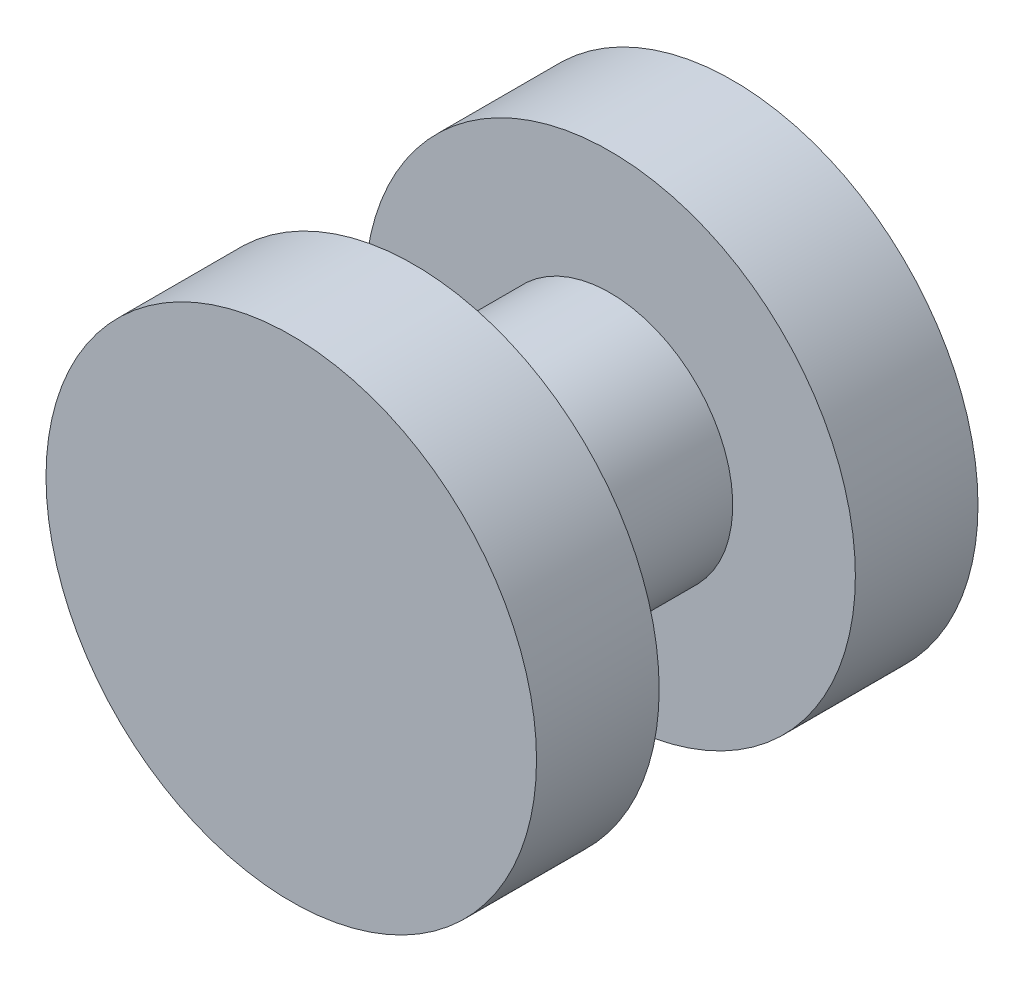
ISO-10303-21;
HEADER;
FILE_DESCRIPTION(('STEP AP214'),'2;1');
FILE_NAME('part.step','',(''),(''),'','','');
FILE_SCHEMA(('AUTOMOTIVE_DESIGN { 1 0 10303 214 1 1 1 1 }'));
ENDSEC;
DATA;
#1=APPLICATION_CONTEXT('core data for automotive mechanical design processes');
#2=APPLICATION_PROTOCOL_DEFINITION('international standard','automotive_design',2000,#1);
#3=PRODUCT_CONTEXT('',#1,'mechanical');
#4=PRODUCT('Part','Part','',(#3));
#5=PRODUCT_RELATED_PRODUCT_CATEGORY('part','',(#4));
#6=PRODUCT_DEFINITION_FORMATION('','',#4);
#7=PRODUCT_DEFINITION_CONTEXT('part definition',#1,'design');
#8=PRODUCT_DEFINITION('design','',#6,#7);
#9=PRODUCT_DEFINITION_SHAPE('','',#8);
#10=(LENGTH_UNIT() NAMED_UNIT(*) SI_UNIT(.MILLI.,.METRE.));
#11=(NAMED_UNIT(*) PLANE_ANGLE_UNIT() SI_UNIT($,.RADIAN.));
#12=(NAMED_UNIT(*) SI_UNIT($,.STERADIAN.) SOLID_ANGLE_UNIT());
#13=UNCERTAINTY_MEASURE_WITH_UNIT(LENGTH_MEASURE(1.E-05),#10,'distance_accuracy_value','');
#14=(GEOMETRIC_REPRESENTATION_CONTEXT(3) GLOBAL_UNCERTAINTY_ASSIGNED_CONTEXT((#13)) GLOBAL_UNIT_ASSIGNED_CONTEXT((#10,
#11,#12)) REPRESENTATION_CONTEXT('',''));
#15=CARTESIAN_POINT('',(0.,0.,0.));
#16=DIRECTION('',(0.,0.,1.));
#17=DIRECTION('',(1.,0.,0.));
#18=AXIS2_PLACEMENT_3D('',#15,#16,#17);
#19=CARTESIAN_POINT('',(0.,0.,5.08));
#20=DIRECTION('',(0.,0.,-1.));
#21=DIRECTION('',(-1.,0.,0.));
#22=AXIS2_PLACEMENT_3D('',#19,#20,#21);
#23=CYLINDRICAL_SURFACE('',#22,3.175);
#24=CARTESIAN_POINT('',(0.,0.,5.08));
#25=DIRECTION('',(0.,0.,1.));
#26=DIRECTION('',(1.,0.,0.));
#27=AXIS2_PLACEMENT_3D('',#24,#25,#26);
#28=CIRCLE('',#27,3.175);
#29=CARTESIAN_POINT('',(3.175,0.,5.08));
#30=VERTEX_POINT('',#29);
#31=EDGE_CURVE('E10',#30,#30,#28,.T.);
#32=ORIENTED_EDGE('',*,*,#31,.F.);
#33=EDGE_LOOP('',(#32));
#34=FACE_BOUND('',#33,.T.);
#35=CARTESIAN_POINT('',(0.,0.,0.));
#36=DIRECTION('',(0.,0.,-1.));
#37=DIRECTION('',(-1.,0.,0.));
#38=AXIS2_PLACEMENT_3D('',#35,#36,#37);
#39=CIRCLE('',#38,3.175);
#40=CARTESIAN_POINT('',(-3.175,0.,0.));
#41=VERTEX_POINT('',#40);
#42=EDGE_CURVE('E36',#41,#41,#39,.T.);
#43=ORIENTED_EDGE('',*,*,#42,.F.);
#44=EDGE_LOOP('',(#43));
#45=FACE_BOUND('',#44,.T.);
#46=ADVANCED_FACE('F30',(#34,#45),#23,.T.);
#47=CARTESIAN_POINT('',(0.,0.,0.));
#48=DIRECTION('',(0.,0.,-1.));
#49=DIRECTION('',(-1.,0.,0.));
#50=AXIS2_PLACEMENT_3D('',#47,#48,#49);
#51=PLANE('',#50);
#52=CARTESIAN_POINT('',(0.,0.,0.));
#53=DIRECTION('',(0.,0.,-1.));
#54=DIRECTION('',(-1.,0.,0.));
#55=AXIS2_PLACEMENT_3D('',#52,#53,#54);
#56=CIRCLE('',#55,6.35);
#57=CARTESIAN_POINT('',(-6.35,0.,0.));
#58=VERTEX_POINT('',#57);
#59=EDGE_CURVE('E44',#58,#58,#56,.T.);
#60=ORIENTED_EDGE('',*,*,#59,.F.);
#61=EDGE_LOOP('',(#60));
#62=FACE_BOUND('',#61,.T.);
#63=ORIENTED_EDGE('',*,*,#42,.T.);
#64=EDGE_LOOP('',(#63));
#65=FACE_BOUND('',#64,.T.);
#66=ADVANCED_FACE('F76',(#62,#65),#51,.F.);
#67=CARTESIAN_POINT('',(0.,0.,-3.175));
#68=DIRECTION('',(0.,0.,1.));
#69=DIRECTION('',(1.,0.,0.));
#70=AXIS2_PLACEMENT_3D('',#67,#68,#69);
#71=CYLINDRICAL_SURFACE('',#70,6.35);
#72=CARTESIAN_POINT('',(0.,0.,-3.175));
#73=DIRECTION('',(0.,0.,-1.));
#74=DIRECTION('',(-1.,0.,0.));
#75=AXIS2_PLACEMENT_3D('',#72,#73,#74);
#76=CIRCLE('',#75,6.35);
#77=CARTESIAN_POINT('',(-6.35,0.,-3.175));
#78=VERTEX_POINT('',#77);
#79=EDGE_CURVE('E40',#78,#78,#76,.T.);
#80=ORIENTED_EDGE('',*,*,#79,.F.);
#81=EDGE_LOOP('',(#80));
#82=FACE_BOUND('',#81,.T.);
#83=ORIENTED_EDGE('',*,*,#59,.T.);
#84=EDGE_LOOP('',(#83));
#85=FACE_BOUND('',#84,.T.);
#86=ADVANCED_FACE('F71',(#82,#85),#71,.T.);
#87=CARTESIAN_POINT('',(0.,0.,-3.175));
#88=DIRECTION('',(0.,0.,-1.));
#89=DIRECTION('',(-1.,0.,0.));
#90=AXIS2_PLACEMENT_3D('',#87,#88,#89);
#91=PLANE('',#90);
#92=ORIENTED_EDGE('',*,*,#79,.T.);
#93=EDGE_LOOP('',(#92));
#94=FACE_BOUND('',#93,.T.);
#95=ADVANCED_FACE('F66',(#94),#91,.T.);
#96=CARTESIAN_POINT('',(0.,0.,5.08));
#97=DIRECTION('',(0.,0.,1.));
#98=DIRECTION('',(1.,0.,0.));
#99=AXIS2_PLACEMENT_3D('',#96,#97,#98);
#100=PLANE('',#99);
#101=CARTESIAN_POINT('',(0.,0.,5.08));
#102=DIRECTION('',(0.,0.,1.));
#103=DIRECTION('',(1.,0.,0.));
#104=AXIS2_PLACEMENT_3D('',#101,#102,#103);
#105=CIRCLE('',#104,6.35);
#106=CARTESIAN_POINT('',(6.35,0.,5.08));
#107=VERTEX_POINT('',#106);
#108=EDGE_CURVE('E50',#107,#107,#105,.T.);
#109=ORIENTED_EDGE('',*,*,#108,.F.);
#110=EDGE_LOOP('',(#109));
#111=FACE_BOUND('',#110,.T.);
#112=ORIENTED_EDGE('',*,*,#31,.T.);
#113=EDGE_LOOP('',(#112));
#114=FACE_BOUND('',#113,.T.);
#115=ADVANCED_FACE('F61',(#111,#114),#100,.F.);
#116=CARTESIAN_POINT('',(0.,0.,8.255));
#117=DIRECTION('',(0.,0.,-1.));
#118=DIRECTION('',(-1.,0.,0.));
#119=AXIS2_PLACEMENT_3D('',#116,#117,#118);
#120=CYLINDRICAL_SURFACE('',#119,6.35);
#121=CARTESIAN_POINT('',(0.,0.,8.255));
#122=DIRECTION('',(0.,0.,1.));
#123=DIRECTION('',(1.,0.,0.));
#124=AXIS2_PLACEMENT_3D('',#121,#122,#123);
#125=CIRCLE('',#124,6.35);
#126=CARTESIAN_POINT('',(6.35,0.,8.255));
#127=VERTEX_POINT('',#126);
#128=EDGE_CURVE('E48',#127,#127,#125,.T.);
#129=ORIENTED_EDGE('',*,*,#128,.F.);
#130=EDGE_LOOP('',(#129));
#131=FACE_BOUND('',#130,.T.);
#132=ORIENTED_EDGE('',*,*,#108,.T.);
#133=EDGE_LOOP('',(#132));
#134=FACE_BOUND('',#133,.T.);
#135=ADVANCED_FACE('F58',(#131,#134),#120,.T.);
#136=CARTESIAN_POINT('',(0.,0.,8.255));
#137=DIRECTION('',(0.,0.,1.));
#138=DIRECTION('',(1.,0.,0.));
#139=AXIS2_PLACEMENT_3D('',#136,#137,#138);
#140=PLANE('',#139);
#141=ORIENTED_EDGE('',*,*,#128,.T.);
#142=EDGE_LOOP('',(#141));
#143=FACE_BOUND('',#142,.T.);
#144=ADVANCED_FACE('F56',(#143),#140,.T.);
#145=CLOSED_SHELL('',(#46,#66,#86,#95,#115,#135,#144));
#146=MANIFOLD_SOLID_BREP('B2',#145);
#147=ADVANCED_BREP_SHAPE_REPRESENTATION('',(#18,#146),#14);
#148=SHAPE_DEFINITION_REPRESENTATION(#9,#147);
ENDSEC;
END-ISO-10303-21;
